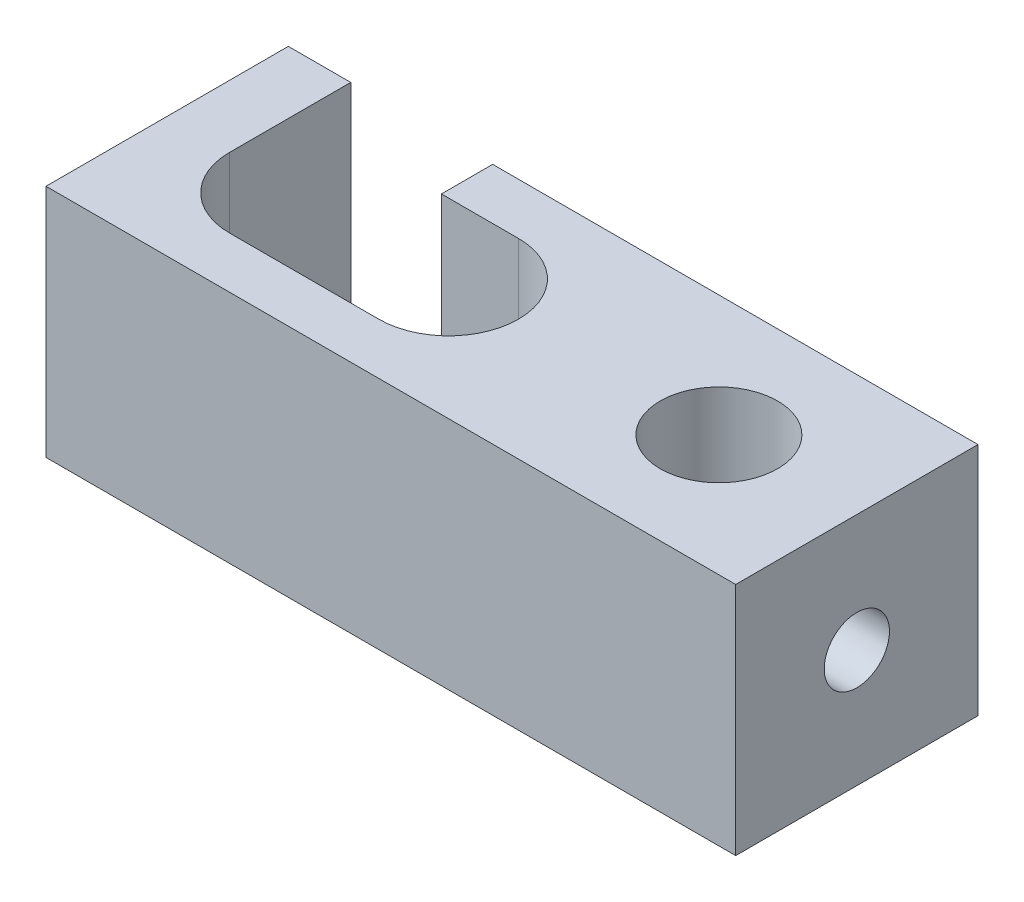
ISO-10303-21;
HEADER;
FILE_DESCRIPTION(('STEP AP214'),'2;1');
FILE_NAME('part.step','',(''),(''),'','','');
FILE_SCHEMA(('AUTOMOTIVE_DESIGN { 1 0 10303 214 1 1 1 1 }'));
ENDSEC;
DATA;
#1=APPLICATION_CONTEXT('core data for automotive mechanical design processes');
#2=APPLICATION_PROTOCOL_DEFINITION('international standard','automotive_design',2000,#1);
#3=PRODUCT_CONTEXT('',#1,'mechanical');
#4=PRODUCT('Part','Part','',(#3));
#5=PRODUCT_RELATED_PRODUCT_CATEGORY('part','',(#4));
#6=PRODUCT_DEFINITION_FORMATION('','',#4);
#7=PRODUCT_DEFINITION_CONTEXT('part definition',#1,'design');
#8=PRODUCT_DEFINITION('design','',#6,#7);
#9=PRODUCT_DEFINITION_SHAPE('','',#8);
#10=(LENGTH_UNIT() NAMED_UNIT(*) SI_UNIT(.MILLI.,.METRE.));
#11=(NAMED_UNIT(*) PLANE_ANGLE_UNIT() SI_UNIT($,.RADIAN.));
#12=(NAMED_UNIT(*) SI_UNIT($,.STERADIAN.) SOLID_ANGLE_UNIT());
#13=UNCERTAINTY_MEASURE_WITH_UNIT(LENGTH_MEASURE(1.E-05),#10,'distance_accuracy_value','');
#14=(GEOMETRIC_REPRESENTATION_CONTEXT(3) GLOBAL_UNCERTAINTY_ASSIGNED_CONTEXT((#13)) GLOBAL_UNIT_ASSIGNED_CONTEXT((#10,
#11,#12)) REPRESENTATION_CONTEXT('',''));
#15=CARTESIAN_POINT('',(0.,0.,0.));
#16=DIRECTION('',(0.,0.,1.));
#17=DIRECTION('',(1.,0.,0.));
#18=AXIS2_PLACEMENT_3D('',#15,#16,#17);
#19=CARTESIAN_POINT('',(-1.7,-3.15,0.));
#20=DIRECTION('',(0.,1.,0.));
#21=DIRECTION('',(0.,0.,1.));
#22=AXIS2_PLACEMENT_3D('',#19,#20,#21);
#23=CYLINDRICAL_SURFACE('',#22,1.875);
#24=DIRECTION('',(0.,1.,0.));
#25=VECTOR('',#24,1.);
#26=CARTESIAN_POINT('',(-1.7,-3.15,1.875));
#27=LINE('',#26,#25);
#28=CARTESIAN_POINT('',(-1.7,-3.15,1.875));
#29=VERTEX_POINT('',#28);
#30=CARTESIAN_POINT('',(-1.7,3.15,1.875));
#31=VERTEX_POINT('',#30);
#32=EDGE_CURVE('E164',#29,#31,#27,.T.);
#33=ORIENTED_EDGE('',*,*,#32,.T.);
#34=CARTESIAN_POINT('',(-1.7,3.15,0.));
#35=DIRECTION('',(0.,1.,0.));
#36=DIRECTION('',(0.,0.,1.));
#37=AXIS2_PLACEMENT_3D('',#34,#35,#36);
#38=CIRCLE('',#37,1.875);
#39=CARTESIAN_POINT('',(-1.7,3.15,-1.875));
#40=VERTEX_POINT('',#39);
#41=EDGE_CURVE('E302',#31,#40,#38,.T.);
#42=ORIENTED_EDGE('',*,*,#41,.T.);
#43=DIRECTION('',(0.,1.,0.));
#44=VECTOR('',#43,1.);
#45=CARTESIAN_POINT('',(-1.7,-3.15,-1.875));
#46=LINE('',#45,#44);
#47=CARTESIAN_POINT('',(-1.7,-3.15,-1.875));
#48=VERTEX_POINT('',#47);
#49=EDGE_CURVE('E52',#48,#40,#46,.T.);
#50=ORIENTED_EDGE('',*,*,#49,.F.);
#51=CARTESIAN_POINT('',(-1.7,-3.15,0.));
#52=DIRECTION('',(0.,1.,0.));
#53=DIRECTION('',(0.,0.,1.));
#54=AXIS2_PLACEMENT_3D('',#51,#52,#53);
#55=CIRCLE('',#54,1.875);
#56=EDGE_CURVE('E65',#29,#48,#55,.T.);
#57=ORIENTED_EDGE('',*,*,#56,.F.);
#58=EDGE_LOOP('',(#33,#42,#50,#57));
#59=FACE_BOUND('',#58,.T.);
#60=ADVANCED_FACE('F44',(#59),#23,.F.);
#61=CARTESIAN_POINT('',(0.,-3.15,-1.875));
#62=DIRECTION('',(0.,0.,1.));
#63=DIRECTION('',(1.,0.,0.));
#64=AXIS2_PLACEMENT_3D('',#61,#62,#63);
#65=PLANE('',#64);
#66=ORIENTED_EDGE('',*,*,#49,.T.);
#67=DIRECTION('',(1.,0.,0.));
#68=VECTOR('',#67,1.);
#69=CARTESIAN_POINT('',(0.,3.15,-1.875));
#70=LINE('',#69,#68);
#71=CARTESIAN_POINT('',(-3.7683304099387,3.15,-1.875));
#72=VERTEX_POINT('',#71);
#73=EDGE_CURVE('E238',#72,#40,#70,.T.);
#74=ORIENTED_EDGE('',*,*,#73,.F.);
#75=DIRECTION('',(0.,1.,0.));
#76=VECTOR('',#75,1.);
#77=CARTESIAN_POINT('',(-3.7683304099387,-3.15,-1.875));
#78=LINE('',#77,#76);
#79=CARTESIAN_POINT('',(-3.7683304099387,-3.15,-1.875));
#80=VERTEX_POINT('',#79);
#81=EDGE_CURVE('E185',#80,#72,#78,.T.);
#82=ORIENTED_EDGE('',*,*,#81,.F.);
#83=DIRECTION('',(1.,0.,0.));
#84=VECTOR('',#83,1.);
#85=CARTESIAN_POINT('',(0.,-3.15,-1.875));
#86=LINE('',#85,#84);
#87=EDGE_CURVE('E173',#80,#48,#86,.T.);
#88=ORIENTED_EDGE('',*,*,#87,.T.);
#89=EDGE_LOOP('',(#66,#74,#82,#88));
#90=FACE_BOUND('',#89,.T.);
#91=ADVANCED_FACE('F305',(#90),#65,.T.);
#92=CARTESIAN_POINT('',(-3.7683304099387,-3.15,0.));
#93=DIRECTION('',(1.,0.,0.));
#94=DIRECTION('',(0.,0.,-1.));
#95=AXIS2_PLACEMENT_3D('',#92,#93,#94);
#96=PLANE('',#95);
#97=ORIENTED_EDGE('',*,*,#81,.T.);
#98=DIRECTION('',(0.,0.,-1.));
#99=VECTOR('',#98,1.);
#100=CARTESIAN_POINT('',(-3.7683304099387,3.15,0.));
#101=LINE('',#100,#99);
#102=CARTESIAN_POINT('',(-3.7683304099387,3.15,-3.25));
#103=VERTEX_POINT('',#102);
#104=EDGE_CURVE('E230',#72,#103,#101,.T.);
#105=ORIENTED_EDGE('',*,*,#104,.T.);
#106=DIRECTION('',(0.,1.,0.));
#107=VECTOR('',#106,1.);
#108=CARTESIAN_POINT('',(-3.7683304099387,-3.15,-3.25));
#109=LINE('',#108,#107);
#110=CARTESIAN_POINT('',(-3.7683304099387,-3.15,-3.25));
#111=VERTEX_POINT('',#110);
#112=EDGE_CURVE('E188',#111,#103,#109,.T.);
#113=ORIENTED_EDGE('',*,*,#112,.F.);
#114=DIRECTION('',(0.,0.,-1.));
#115=VECTOR('',#114,1.);
#116=CARTESIAN_POINT('',(-3.7683304099387,-3.15,0.));
#117=LINE('',#116,#115);
#118=EDGE_CURVE('E179',#80,#111,#117,.T.);
#119=ORIENTED_EDGE('',*,*,#118,.F.);
#120=EDGE_LOOP('',(#97,#105,#113,#119));
#121=FACE_BOUND('',#120,.T.);
#122=ADVANCED_FACE('F308',(#121),#96,.F.);
#123=CARTESIAN_POINT('',(0.,-3.15,-3.25));
#124=DIRECTION('',(0.,0.,1.));
#125=DIRECTION('',(1.,0.,0.));
#126=AXIS2_PLACEMENT_3D('',#123,#124,#125);
#127=PLANE('',#126);
#128=ORIENTED_EDGE('',*,*,#112,.T.);
#129=DIRECTION('',(1.,0.,0.));
#130=VECTOR('',#129,1.);
#131=CARTESIAN_POINT('',(0.,3.15,-3.25));
#132=LINE('',#131,#130);
#133=CARTESIAN_POINT('',(9.25,3.15,-3.25));
#134=VERTEX_POINT('',#133);
#135=EDGE_CURVE('E224',#103,#134,#132,.T.);
#136=ORIENTED_EDGE('',*,*,#135,.T.);
#137=DIRECTION('',(0.,1.,0.));
#138=VECTOR('',#137,1.);
#139=CARTESIAN_POINT('',(9.25,-3.15,-3.25));
#140=LINE('',#139,#138);
#141=CARTESIAN_POINT('',(9.25,-3.15,-3.25));
#142=VERTEX_POINT('',#141);
#143=EDGE_CURVE('E191',#142,#134,#140,.T.);
#144=ORIENTED_EDGE('',*,*,#143,.F.);
#145=DIRECTION('',(1.,0.,0.));
#146=VECTOR('',#145,1.);
#147=CARTESIAN_POINT('',(0.,-3.15,-3.25));
#148=LINE('',#147,#146);
#149=EDGE_CURVE('E270',#111,#142,#148,.T.);
#150=ORIENTED_EDGE('',*,*,#149,.F.);
#151=EDGE_LOOP('',(#128,#136,#144,#150));
#152=FACE_BOUND('',#151,.T.);
#153=ADVANCED_FACE('F288',(#152),#127,.F.);
#154=CARTESIAN_POINT('',(9.25,-3.15,0.));
#155=DIRECTION('',(-1.,0.,0.));
#156=DIRECTION('',(0.,0.,1.));
#157=AXIS2_PLACEMENT_3D('',#154,#155,#156);
#158=PLANE('',#157);
#159=CARTESIAN_POINT('',(9.25,0.,0.));
#160=DIRECTION('',(1.,0.,0.));
#161=DIRECTION('',(0.,0.,-1.));
#162=AXIS2_PLACEMENT_3D('',#159,#160,#161);
#163=CIRCLE('',#162,0.874999999999987);
#164=CARTESIAN_POINT('',(9.25,0.,-0.874999999999987));
#165=VERTEX_POINT('',#164);
#166=EDGE_CURVE('E327',#165,#165,#163,.T.);
#167=ORIENTED_EDGE('',*,*,#166,.F.);
#168=EDGE_LOOP('',(#167));
#169=FACE_BOUND('',#168,.T.);
#170=ORIENTED_EDGE('',*,*,#143,.T.);
#171=DIRECTION('',(0.,0.,1.));
#172=VECTOR('',#171,1.);
#173=CARTESIAN_POINT('',(9.25,3.15,0.));
#174=LINE('',#173,#172);
#175=CARTESIAN_POINT('',(9.25,3.15,3.25));
#176=VERTEX_POINT('',#175);
#177=EDGE_CURVE('E231',#134,#176,#174,.T.);
#178=ORIENTED_EDGE('',*,*,#177,.T.);
#179=DIRECTION('',(0.,1.,0.));
#180=VECTOR('',#179,1.);
#181=CARTESIAN_POINT('',(9.25,-3.15,3.25));
#182=LINE('',#181,#180);
#183=CARTESIAN_POINT('',(9.25,-3.15,3.25));
#184=VERTEX_POINT('',#183);
#185=EDGE_CURVE('E194',#184,#176,#182,.T.);
#186=ORIENTED_EDGE('',*,*,#185,.F.);
#187=DIRECTION('',(0.,0.,1.));
#188=VECTOR('',#187,1.);
#189=CARTESIAN_POINT('',(9.25,-3.15,0.));
#190=LINE('',#189,#188);
#191=EDGE_CURVE('E278',#142,#184,#190,.T.);
#192=ORIENTED_EDGE('',*,*,#191,.F.);
#193=EDGE_LOOP('',(#170,#178,#186,#192));
#194=FACE_BOUND('',#193,.T.);
#195=ADVANCED_FACE('F289',(#169,#194),#158,.F.);
#196=CARTESIAN_POINT('',(0.,-3.15,3.25));
#197=DIRECTION('',(0.,0.,1.));
#198=DIRECTION('',(1.,0.,0.));
#199=AXIS2_PLACEMENT_3D('',#196,#197,#198);
#200=PLANE('',#199);
#201=ORIENTED_EDGE('',*,*,#185,.T.);
#202=DIRECTION('',(1.,0.,0.));
#203=VECTOR('',#202,1.);
#204=CARTESIAN_POINT('',(0.,3.15,3.25));
#205=LINE('',#204,#203);
#206=CARTESIAN_POINT('',(-9.25,3.15,3.25));
#207=VERTEX_POINT('',#206);
#208=EDGE_CURVE('E226',#207,#176,#205,.T.);
#209=ORIENTED_EDGE('',*,*,#208,.F.);
#210=DIRECTION('',(0.,1.,0.));
#211=VECTOR('',#210,1.);
#212=CARTESIAN_POINT('',(-9.25,-3.15,3.25));
#213=LINE('',#212,#211);
#214=CARTESIAN_POINT('',(-9.25,-3.15,3.25));
#215=VERTEX_POINT('',#214);
#216=EDGE_CURVE('E197',#215,#207,#213,.T.);
#217=ORIENTED_EDGE('',*,*,#216,.F.);
#218=DIRECTION('',(1.,0.,0.));
#219=VECTOR('',#218,1.);
#220=CARTESIAN_POINT('',(0.,-3.15,3.25));
#221=LINE('',#220,#219);
#222=EDGE_CURVE('E274',#215,#184,#221,.T.);
#223=ORIENTED_EDGE('',*,*,#222,.T.);
#224=EDGE_LOOP('',(#201,#209,#217,#223));
#225=FACE_BOUND('',#224,.T.);
#226=ADVANCED_FACE('F292',(#225),#200,.T.);
#227=CARTESIAN_POINT('',(-9.25,-3.15,0.));
#228=DIRECTION('',(-1.,0.,0.));
#229=DIRECTION('',(0.,0.,1.));
#230=AXIS2_PLACEMENT_3D('',#227,#228,#229);
#231=PLANE('',#230);
#232=CARTESIAN_POINT('',(-9.25,0.,0.));
#233=DIRECTION('',(-1.,0.,0.));
#234=DIRECTION('',(0.,0.,1.));
#235=AXIS2_PLACEMENT_3D('',#232,#233,#234);
#236=CIRCLE('',#235,0.875);
#237=CARTESIAN_POINT('',(-9.25,0.,0.875));
#238=VERTEX_POINT('',#237);
#239=EDGE_CURVE('E136',#238,#238,#236,.T.);
#240=ORIENTED_EDGE('',*,*,#239,.F.);
#241=EDGE_LOOP('',(#240));
#242=FACE_BOUND('',#241,.T.);
#243=ORIENTED_EDGE('',*,*,#216,.T.);
#244=DIRECTION('',(0.,0.,1.));
#245=VECTOR('',#244,1.);
#246=CARTESIAN_POINT('',(-9.25,3.15,0.));
#247=LINE('',#246,#245);
#248=CARTESIAN_POINT('',(-9.25,3.15,-3.25));
#249=VERTEX_POINT('',#248);
#250=EDGE_CURVE('E222',#249,#207,#247,.T.);
#251=ORIENTED_EDGE('',*,*,#250,.F.);
#252=DIRECTION('',(0.,1.,0.));
#253=VECTOR('',#252,1.);
#254=CARTESIAN_POINT('',(-9.25,-3.15,-3.25));
#255=LINE('',#254,#253);
#256=CARTESIAN_POINT('',(-9.25,-3.15,-3.25));
#257=VERTEX_POINT('',#256);
#258=EDGE_CURVE('E199',#257,#249,#255,.T.);
#259=ORIENTED_EDGE('',*,*,#258,.F.);
#260=DIRECTION('',(0.,0.,1.));
#261=VECTOR('',#260,1.);
#262=CARTESIAN_POINT('',(-9.25,-3.15,0.));
#263=LINE('',#262,#261);
#264=EDGE_CURVE('E269',#257,#215,#263,.T.);
#265=ORIENTED_EDGE('',*,*,#264,.T.);
#266=EDGE_LOOP('',(#243,#251,#259,#265));
#267=FACE_BOUND('',#266,.T.);
#268=ADVANCED_FACE('F295',(#242,#267),#231,.T.);
#269=ORIENTED_EDGE('',*,*,#258,.T.);
#270=CARTESIAN_POINT('',(-7.575,3.15,-3.25));
#271=VERTEX_POINT('',#270);
#272=EDGE_CURVE('E215',#249,#271,#132,.T.);
#273=ORIENTED_EDGE('',*,*,#272,.T.);
#274=DIRECTION('',(0.,1.,0.));
#275=VECTOR('',#274,1.);
#276=CARTESIAN_POINT('',(-7.575,-3.15,-3.25));
#277=LINE('',#276,#275);
#278=CARTESIAN_POINT('',(-7.575,-3.15,-3.25));
#279=VERTEX_POINT('',#278);
#280=EDGE_CURVE('E159',#279,#271,#277,.T.);
#281=ORIENTED_EDGE('',*,*,#280,.F.);
#282=EDGE_CURVE('E266',#257,#279,#148,.T.);
#283=ORIENTED_EDGE('',*,*,#282,.F.);
#284=EDGE_LOOP('',(#269,#273,#281,#283));
#285=FACE_BOUND('',#284,.T.);
#286=ADVANCED_FACE('F220',(#285),#127,.F.);
#287=CARTESIAN_POINT('',(-7.575,-3.15,0.));
#288=DIRECTION('',(1.,0.,0.));
#289=DIRECTION('',(0.,0.,-1.));
#290=AXIS2_PLACEMENT_3D('',#287,#288,#289);
#291=PLANE('',#290);
#292=CARTESIAN_POINT('',(-7.575,0.,0.));
#293=DIRECTION('',(1.,0.,0.));
#294=DIRECTION('',(0.,0.,-1.));
#295=AXIS2_PLACEMENT_3D('',#292,#293,#294);
#296=CIRCLE('',#295,0.875);
#297=CARTESIAN_POINT('',(-7.575,-0.875,0.));
#298=VERTEX_POINT('',#297);
#299=CARTESIAN_POINT('',(-7.575,0.875,0.));
#300=VERTEX_POINT('',#299);
#301=EDGE_CURVE('E11',#298,#300,#296,.T.);
#302=ORIENTED_EDGE('',*,*,#301,.F.);
#303=DIRECTION('',(0.,1.,0.));
#304=VECTOR('',#303,1.);
#305=CARTESIAN_POINT('',(-7.575,-3.15,0.));
#306=LINE('',#305,#304);
#307=CARTESIAN_POINT('',(-7.575,-3.15,0.));
#308=VERTEX_POINT('',#307);
#309=EDGE_CURVE('E154',#308,#298,#306,.T.);
#310=ORIENTED_EDGE('',*,*,#309,.F.);
#311=DIRECTION('',(0.,0.,-1.));
#312=VECTOR('',#311,1.);
#313=CARTESIAN_POINT('',(-7.575,-3.15,0.));
#314=LINE('',#313,#312);
#315=EDGE_CURVE('E209',#308,#279,#314,.T.);
#316=ORIENTED_EDGE('',*,*,#315,.T.);
#317=ORIENTED_EDGE('',*,*,#280,.T.);
#318=DIRECTION('',(0.,0.,-1.));
#319=VECTOR('',#318,1.);
#320=CARTESIAN_POINT('',(-7.575,3.15,0.));
#321=LINE('',#320,#319);
#322=CARTESIAN_POINT('',(-7.575,3.15,0.));
#323=VERTEX_POINT('',#322);
#324=EDGE_CURVE('E147',#323,#271,#321,.T.);
#325=ORIENTED_EDGE('',*,*,#324,.F.);
#326=EDGE_CURVE('E144',#300,#323,#306,.T.);
#327=ORIENTED_EDGE('',*,*,#326,.F.);
#328=EDGE_LOOP('',(#302,#310,#316,#317,#325,#327));
#329=FACE_BOUND('',#328,.T.);
#330=ADVANCED_FACE('F145',(#329),#291,.T.);
#331=CARTESIAN_POINT('',(-5.7,-3.15,0.));
#332=DIRECTION('',(0.,1.,0.));
#333=DIRECTION('',(0.,0.,1.));
#334=AXIS2_PLACEMENT_3D('',#331,#332,#333);
#335=CYLINDRICAL_SURFACE('',#334,1.875);
#336=ORIENTED_EDGE('',*,*,#309,.T.);
#337=EDGE_CURVE('E133',#298,#300,#306,.T.);
#338=ORIENTED_EDGE('',*,*,#337,.T.);
#339=ORIENTED_EDGE('',*,*,#326,.T.);
#340=CARTESIAN_POINT('',(-5.7,3.15,0.));
#341=DIRECTION('',(0.,1.,0.));
#342=DIRECTION('',(0.,0.,1.));
#343=AXIS2_PLACEMENT_3D('',#340,#341,#342);
#344=CIRCLE('',#343,1.875);
#345=CARTESIAN_POINT('',(-5.7,3.15,1.875));
#346=VERTEX_POINT('',#345);
#347=EDGE_CURVE('E217',#323,#346,#344,.T.);
#348=ORIENTED_EDGE('',*,*,#347,.T.);
#349=DIRECTION('',(0.,1.,0.));
#350=VECTOR('',#349,1.);
#351=CARTESIAN_POINT('',(-5.7,-3.15,1.875));
#352=LINE('',#351,#350);
#353=CARTESIAN_POINT('',(-5.7,-3.15,1.875));
#354=VERTEX_POINT('',#353);
#355=EDGE_CURVE('E152',#354,#346,#352,.T.);
#356=ORIENTED_EDGE('',*,*,#355,.F.);
#357=CARTESIAN_POINT('',(-5.7,-3.15,0.));
#358=DIRECTION('',(0.,1.,0.));
#359=DIRECTION('',(0.,0.,1.));
#360=AXIS2_PLACEMENT_3D('',#357,#358,#359);
#361=CIRCLE('',#360,1.875);
#362=EDGE_CURVE('E261',#308,#354,#361,.T.);
#363=ORIENTED_EDGE('',*,*,#362,.F.);
#364=EDGE_LOOP('',(#336,#338,#339,#348,#356,#363));
#365=FACE_BOUND('',#364,.T.);
#366=ADVANCED_FACE('F155',(#365),#335,.F.);
#367=CARTESIAN_POINT('',(0.,-3.15,1.875));
#368=DIRECTION('',(0.,0.,1.));
#369=DIRECTION('',(1.,0.,0.));
#370=AXIS2_PLACEMENT_3D('',#367,#368,#369);
#371=PLANE('',#370);
#372=ORIENTED_EDGE('',*,*,#355,.T.);
#373=DIRECTION('',(1.,0.,0.));
#374=VECTOR('',#373,1.);
#375=CARTESIAN_POINT('',(0.,3.15,1.875));
#376=LINE('',#375,#374);
#377=EDGE_CURVE('E301',#346,#31,#376,.T.);
#378=ORIENTED_EDGE('',*,*,#377,.T.);
#379=ORIENTED_EDGE('',*,*,#32,.F.);
#380=DIRECTION('',(1.,0.,0.));
#381=VECTOR('',#380,1.);
#382=CARTESIAN_POINT('',(0.,-3.15,1.875));
#383=LINE('',#382,#381);
#384=EDGE_CURVE('E258',#354,#29,#383,.T.);
#385=ORIENTED_EDGE('',*,*,#384,.F.);
#386=EDGE_LOOP('',(#372,#378,#379,#385));
#387=FACE_BOUND('',#386,.T.);
#388=ADVANCED_FACE('F300',(#387),#371,.F.);
#389=CARTESIAN_POINT('',(5.55,-3.15,0.));
#390=DIRECTION('',(0.,1.,0.));
#391=DIRECTION('',(0.,0.,1.));
#392=AXIS2_PLACEMENT_3D('',#389,#390,#391);
#393=CYLINDRICAL_SURFACE('',#392,1.575);
#394=CARTESIAN_POINT('',(6.85958008537088,0.,-0.874999999999993));
#395=CARTESIAN_POINT('',(6.85958483244842,0.0447549116801976,-0.874996634186916));
#396=CARTESIAN_POINT('',(6.86191080444197,0.0895467912932758,-0.871542321849587));
#397=CARTESIAN_POINT('',(6.87084710283964,0.177687633521627,-0.857933259348882));
#398=CARTESIAN_POINT('',(6.87746447254167,0.221034100650358,-0.847767493451979));
#399=CARTESIAN_POINT('',(6.89396472521373,0.304830878645768,-0.821353857472204));
#400=CARTESIAN_POINT('',(6.90382682568653,0.345297677756753,-0.805144610064047));
#401=CARTESIAN_POINT('',(6.92567130797317,0.422921076617254,-0.767223014543639));
#402=CARTESIAN_POINT('',(6.93765416055516,0.460076938640276,-0.745509444108754));
#403=CARTESIAN_POINT('',(6.96389290834311,0.534245857726678,-0.694574465082818));
#404=CARTESIAN_POINT('',(6.97825574315343,0.570847754265215,-0.664809229825783));
#405=CARTESIAN_POINT('',(7.00677804911533,0.63887121370185,-0.599738127936555));
#406=CARTESIAN_POINT('',(7.02093739092481,0.670289604257162,-0.564428893943616));
#407=CARTESIAN_POINT('',(7.04894374194736,0.72978144200107,-0.485484483289059));
#408=CARTESIAN_POINT('',(7.06265326369617,0.757316115647581,-0.441389793881031));
#409=CARTESIAN_POINT('',(7.08675800247192,0.804384581930024,-0.348287950799823));
#410=CARTESIAN_POINT('',(7.09715579480671,0.823924594854419,-0.299284653393392));
#411=CARTESIAN_POINT('',(7.11268218010185,0.852706991193031,-0.202139859158599));
#412=CARTESIAN_POINT('',(7.11818188216488,0.862680212058053,-0.1542756570111));
#413=CARTESIAN_POINT('',(7.12470694302779,0.874487069681152,-0.0572659289990712));
#414=CARTESIAN_POINT('',(7.12573577861321,0.876327031316963,-0.00812142869511495));
#415=CARTESIAN_POINT('',(7.1233443352345,0.872016779679911,0.084412617599211));
#416=CARTESIAN_POINT('',(7.1203873944797,0.866698764642559,0.127856341967996));
#417=CARTESIAN_POINT('',(7.11110378328927,0.84976183681672,0.213117269459415));
#418=CARTESIAN_POINT('',(7.10477685310287,0.838142438331325,0.254934346937341));
#419=CARTESIAN_POINT('',(7.08923211335444,0.808943318418142,0.336342863276994));
#420=CARTESIAN_POINT('',(7.07998516901716,0.791303376314552,0.375906908198171));
#421=CARTESIAN_POINT('',(7.05938196313068,0.750692915423643,0.451587767002702));
#422=CARTESIAN_POINT('',(7.04802503923511,0.727720722216339,0.487703493015474));
#423=CARTESIAN_POINT('',(7.02274861753602,0.674242989557255,0.559683435107931));
#424=CARTESIAN_POINT('',(7.00868471049903,0.643188639476045,0.595089181530654));
#425=CARTESIAN_POINT('',(6.98027492296265,0.575863353750224,0.660463383526072));
#426=CARTESIAN_POINT('',(6.96592875838326,0.539586903184511,0.690426014134003));
#427=CARTESIAN_POINT('',(6.93709522669696,0.458888999525436,0.74678099273542));
#428=CARTESIAN_POINT('',(6.92271313790371,0.414027180130502,0.77260278439735));
#429=CARTESIAN_POINT('',(6.89727151459968,0.319673392411645,0.81616513019727));
#430=CARTESIAN_POINT('',(6.8862081354601,0.270186869559001,0.833915047769083));
#431=CARTESIAN_POINT('',(6.87002437852975,0.172067295748347,0.859285983590978));
#432=CARTESIAN_POINT('',(6.86449746184824,0.12368591906432,0.867607041155626));
#433=CARTESIAN_POINT('',(6.85893212903442,0.0259230587784332,0.875986136786318));
#434=CARTESIAN_POINT('',(6.85888707616406,-0.0234571430948309,0.876054166560272));
#435=CARTESIAN_POINT('',(6.86386068293651,-0.113855270254691,0.868565281800698));
#436=CARTESIAN_POINT('',(6.86812205598216,-0.155018084759659,0.862148686082426));
#437=CARTESIAN_POINT('',(6.88000063958816,-0.235563291221114,0.84370775255903));
#438=CARTESIAN_POINT('',(6.88761938335336,-0.274944860668918,0.831680852558544));
#439=CARTESIAN_POINT('',(6.90569650138804,-0.352711986179187,0.801888814839559));
#440=CARTESIAN_POINT('',(6.91625904059073,-0.390989458114856,0.783907452337072));
#441=CARTESIAN_POINT('',(6.93898539514335,-0.46421338468672,0.742895776468352));
#442=CARTESIAN_POINT('',(6.95114999094154,-0.49915820140852,0.719862998623212));
#443=CARTESIAN_POINT('',(6.97807453258726,-0.570671930145383,0.665059049432033));
#444=CARTESIAN_POINT('',(6.99293527322256,-0.606583945730789,0.63247635048005));
#445=CARTESIAN_POINT('',(7.02195180807909,-0.672699718555075,0.561648143601167));
#446=CARTESIAN_POINT('',(7.03610716273135,-0.702899948401155,0.523399162212113));
#447=CARTESIAN_POINT('',(7.06305306068402,-0.758251546155118,0.439691151625589));
#448=CARTESIAN_POINT('',(7.07572919090884,-0.783043831159142,0.393954915809068));
#449=CARTESIAN_POINT('',(7.09731723357001,-0.824318705129375,0.298060757360772));
#450=CARTESIAN_POINT('',(7.1062331172625,-0.840810064415993,0.247907567578778));
#451=CARTESIAN_POINT('',(7.11851981950258,-0.863326724063424,0.150146538371873));
#452=CARTESIAN_POINT('',(7.12236615645918,-0.870253099402385,0.102806435950223));
#453=CARTESIAN_POINT('',(7.12570236080862,-0.876267838935578,0.00748688132623668));
#454=CARTESIAN_POINT('',(7.12519462894126,-0.875360522456946,-0.0404922039846694));
#455=CARTESIAN_POINT('',(7.1201356138082,-0.866220035666178,-0.131018110258135));
#456=CARTESIAN_POINT('',(7.11596136238038,-0.858669841367621,-0.173658005776818));
#457=CARTESIAN_POINT('',(7.10446639972849,-0.837522782859506,-0.256958507697884));
#458=CARTESIAN_POINT('',(7.09714532026663,-0.823925210987113,-0.297618881839106));
#459=CARTESIAN_POINT('',(7.07969015596694,-0.790669704926412,-0.377351701443256));
#460=CARTESIAN_POINT('',(7.06947155643965,-0.770827343989581,-0.416328091669447));
#461=CARTESIAN_POINT('',(7.04716968657382,-0.725877165370752,-0.490521186476223));
#462=CARTESIAN_POINT('',(7.03508568185688,-0.700767272547249,-0.525736401067923));
#463=CARTESIAN_POINT('',(7.00851024905587,-0.642648283035056,-0.595762497494336));
#464=CARTESIAN_POINT('',(6.99390232974237,-0.609059895766946,-0.630049033851345));
#465=CARTESIAN_POINT('',(6.96488364027658,-0.536652642819883,-0.692767198178323));
#466=CARTESIAN_POINT('',(6.95047313850578,-0.497827310908001,-0.721191476313163));
#467=CARTESIAN_POINT('',(6.92242945073734,-0.412665111307087,-0.773303507727097));
#468=CARTESIAN_POINT('',(6.90892322248132,-0.365991267071297,-0.796514401156205));
#469=CARTESIAN_POINT('',(6.88598124563273,-0.268445696433374,-0.834433129764272));
#470=CARTESIAN_POINT('',(6.87653270344999,-0.21758777554046,-0.849167740688325));
#471=CARTESIAN_POINT('',(6.86659366994139,-0.138384801257947,-0.864431414859862));
#472=CARTESIAN_POINT('',(6.86398016564645,-0.110927862444265,-0.868384221285563));
#473=CARTESIAN_POINT('',(6.8604719425998,-0.0556520355668384,-0.873669491325514));
#474=CARTESIAN_POINT('',(6.85957713315412,-0.0278331666798168,-0.875002093205697));
#475=CARTESIAN_POINT('',(6.85958008537088,0.,-0.874999999999993));
#476=B_SPLINE_CURVE_WITH_KNOTS('',3,(#394,#395,#396,#397,#398,#399,#400,#401,#402,#403,#404,
#405,#406,#407,#408,#409,#410,#411,#412,#413,#414,#415,#416,#417,#418,#419,#420,#421,#422,#423,
#424,#425,#426,#427,#428,#429,#430,#431,#432,#433,#434,#435,#436,#437,#438,#439,#440,#441,#442,
#443,#444,#445,#446,#447,#448,#449,#450,#451,#452,#453,#454,#455,#456,#457,#458,#459,#460,#461,
#462,#463,#464,#465,#466,#467,#468,#469,#470,#471,#472,#473,#474,#475),.UNSPECIFIED.,.T.,.F.,(4,
2,2,2,2,2,2,2,2,2,2,2,2,2,2,2,2,2,2,2,2,2,2,2,2,2,2,2,2,2,2,2,2,2,2,2,2,2,2,2,4),(0.,
0.134146384092466,0.268513496358011,0.402036217570233,0.535588615644528,0.68293565533889,
0.830372540622395,0.990802379367672,1.15110715635373,1.29786140512594,1.44450150947775,
1.57548364322713,1.7064758742292,1.83881874602741,1.97120323215501,2.11804959654469,
2.2650521949332,2.42539191841616,2.58554516919273,2.73281298054472,2.87990249713077,
3.00496518496982,3.13008504425764,3.26036575502684,3.39071016896346,3.54220942152765,
3.69380193122784,3.85355087382123,4.01313067795222,4.1563182573093,4.29942689119624,
4.4293443594348,4.55927703458963,4.69347843296763,4.82773279953663,4.97761674032733,
5.1276874715518,5.28836664495046,5.44853542130074,5.53196572131828,5.61539161867274),.UNSPECIFIED.);
#477=CARTESIAN_POINT('',(6.85958008537088,0.,-0.874999999999993));
#478=VERTEX_POINT('',#477);
#479=EDGE_CURVE('E137',#478,#478,#476,.T.);
#480=ORIENTED_EDGE('',*,*,#479,.T.);
#481=EDGE_LOOP('',(#480));
#482=FACE_BOUND('',#481,.T.);
#483=CARTESIAN_POINT('',(5.55,-3.15,0.));
#484=DIRECTION('',(0.,1.,0.));
#485=DIRECTION('',(0.,0.,1.));
#486=AXIS2_PLACEMENT_3D('',#483,#484,#485);
#487=CIRCLE('',#486,1.575);
#488=CARTESIAN_POINT('',(5.55,-3.15,1.575));
#489=VERTEX_POINT('',#488);
#490=EDGE_CURVE('E166',#489,#489,#487,.T.);
#491=ORIENTED_EDGE('',*,*,#490,.F.);
#492=EDGE_LOOP('',(#491));
#493=FACE_BOUND('',#492,.T.);
#494=CARTESIAN_POINT('',(5.55,3.15,0.));
#495=DIRECTION('',(0.,1.,0.));
#496=DIRECTION('',(0.,0.,1.));
#497=AXIS2_PLACEMENT_3D('',#494,#495,#496);
#498=CIRCLE('',#497,1.575);
#499=CARTESIAN_POINT('',(5.55,3.15,1.575));
#500=VERTEX_POINT('',#499);
#501=EDGE_CURVE('E252',#500,#500,#498,.T.);
#502=ORIENTED_EDGE('',*,*,#501,.T.);
#503=EDGE_LOOP('',(#502));
#504=FACE_BOUND('',#503,.T.);
#505=ADVANCED_FACE('F350',(#482,#493,#504),#393,.F.);
#506=CARTESIAN_POINT('',(0.,-3.15,0.));
#507=DIRECTION('',(0.,1.,0.));
#508=DIRECTION('',(0.,0.,1.));
#509=AXIS2_PLACEMENT_3D('',#506,#507,#508);
#510=PLANE('',#509);
#511=ORIENTED_EDGE('',*,*,#56,.T.);
#512=ORIENTED_EDGE('',*,*,#87,.F.);
#513=ORIENTED_EDGE('',*,*,#118,.T.);
#514=ORIENTED_EDGE('',*,*,#149,.T.);
#515=ORIENTED_EDGE('',*,*,#191,.T.);
#516=ORIENTED_EDGE('',*,*,#222,.F.);
#517=ORIENTED_EDGE('',*,*,#264,.F.);
#518=ORIENTED_EDGE('',*,*,#282,.T.);
#519=ORIENTED_EDGE('',*,*,#315,.F.);
#520=ORIENTED_EDGE('',*,*,#362,.T.);
#521=ORIENTED_EDGE('',*,*,#384,.T.);
#522=EDGE_LOOP('',(#511,#512,#513,#514,#515,#516,#517,#518,#519,#520,#521));
#523=FACE_BOUND('',#522,.T.);
#524=ORIENTED_EDGE('',*,*,#490,.T.);
#525=EDGE_LOOP('',(#524));
#526=FACE_BOUND('',#525,.T.);
#527=ADVANCED_FACE('F285',(#523,#526),#510,.F.);
#528=CARTESIAN_POINT('',(0.,3.15,0.));
#529=DIRECTION('',(0.,1.,0.));
#530=DIRECTION('',(0.,0.,1.));
#531=AXIS2_PLACEMENT_3D('',#528,#529,#530);
#532=PLANE('',#531);
#533=ORIENTED_EDGE('',*,*,#41,.F.);
#534=ORIENTED_EDGE('',*,*,#377,.F.);
#535=ORIENTED_EDGE('',*,*,#347,.F.);
#536=ORIENTED_EDGE('',*,*,#324,.T.);
#537=ORIENTED_EDGE('',*,*,#272,.F.);
#538=ORIENTED_EDGE('',*,*,#250,.T.);
#539=ORIENTED_EDGE('',*,*,#208,.T.);
#540=ORIENTED_EDGE('',*,*,#177,.F.);
#541=ORIENTED_EDGE('',*,*,#135,.F.);
#542=ORIENTED_EDGE('',*,*,#104,.F.);
#543=ORIENTED_EDGE('',*,*,#73,.T.);
#544=EDGE_LOOP('',(#533,#534,#535,#536,#537,#538,#539,#540,#541,#542,#543));
#545=FACE_BOUND('',#544,.T.);
#546=ORIENTED_EDGE('',*,*,#501,.F.);
#547=EDGE_LOOP('',(#546));
#548=FACE_BOUND('',#547,.T.);
#549=ADVANCED_FACE('F212',(#545,#548),#532,.T.);
#550=CARTESIAN_POINT('',(-7.575,-3.15,0.));
#551=DIRECTION('',(1.,0.,0.));
#552=DIRECTION('',(0.,0.,-1.));
#553=AXIS2_PLACEMENT_3D('',#550,#551,#552);
#554=PLANE('',#553);
#555=CARTESIAN_POINT('',(-7.575,0.,0.));
#556=DIRECTION('',(1.,0.,0.));
#557=DIRECTION('',(0.,0.,-1.));
#558=AXIS2_PLACEMENT_3D('',#555,#556,#557);
#559=CIRCLE('',#558,0.875);
#560=EDGE_CURVE('E57',#298,#300,#559,.F.);
#561=ORIENTED_EDGE('',*,*,#560,.T.);
#562=ORIENTED_EDGE('',*,*,#337,.F.);
#563=EDGE_LOOP('',(#561,#562));
#564=FACE_BOUND('',#563,.T.);
#565=ADVANCED_FACE('F131',(#564),#554,.F.);
#566=CARTESIAN_POINT('',(-9.25,0.,0.));
#567=DIRECTION('',(-1.,0.,0.));
#568=DIRECTION('',(0.,0.,1.));
#569=AXIS2_PLACEMENT_3D('',#566,#567,#568);
#570=CYLINDRICAL_SURFACE('',#569,0.875);
#571=ORIENTED_EDGE('',*,*,#239,.T.);
#572=EDGE_LOOP('',(#571));
#573=FACE_BOUND('',#572,.T.);
#574=ORIENTED_EDGE('',*,*,#301,.T.);
#575=ORIENTED_EDGE('',*,*,#560,.F.);
#576=EDGE_LOOP('',(#574,#575));
#577=FACE_BOUND('',#576,.T.);
#578=ADVANCED_FACE('F140',(#573,#577),#570,.F.);
#579=CARTESIAN_POINT('',(9.25,0.,0.));
#580=DIRECTION('',(1.,0.,0.));
#581=DIRECTION('',(0.,0.,-1.));
#582=AXIS2_PLACEMENT_3D('',#579,#580,#581);
#583=CYLINDRICAL_SURFACE('',#582,0.874999999999993);
#584=ORIENTED_EDGE('',*,*,#479,.F.);
#585=EDGE_LOOP('',(#584));
#586=FACE_BOUND('',#585,.T.);
#587=ORIENTED_EDGE('',*,*,#166,.T.);
#588=EDGE_LOOP('',(#587));
#589=FACE_BOUND('',#588,.T.);
#590=ADVANCED_FACE('F330',(#586,#589),#583,.F.);
#591=CLOSED_SHELL('',(#60,#91,#122,#153,#195,#226,#268,#286,#330,#366,#388,#505,#527,#549,#565,
#578,#590));
#592=MANIFOLD_SOLID_BREP('B2',#591);
#593=ADVANCED_BREP_SHAPE_REPRESENTATION('',(#18,#592),#14);
#594=SHAPE_DEFINITION_REPRESENTATION(#9,#593);
ENDSEC;
END-ISO-10303-21;
